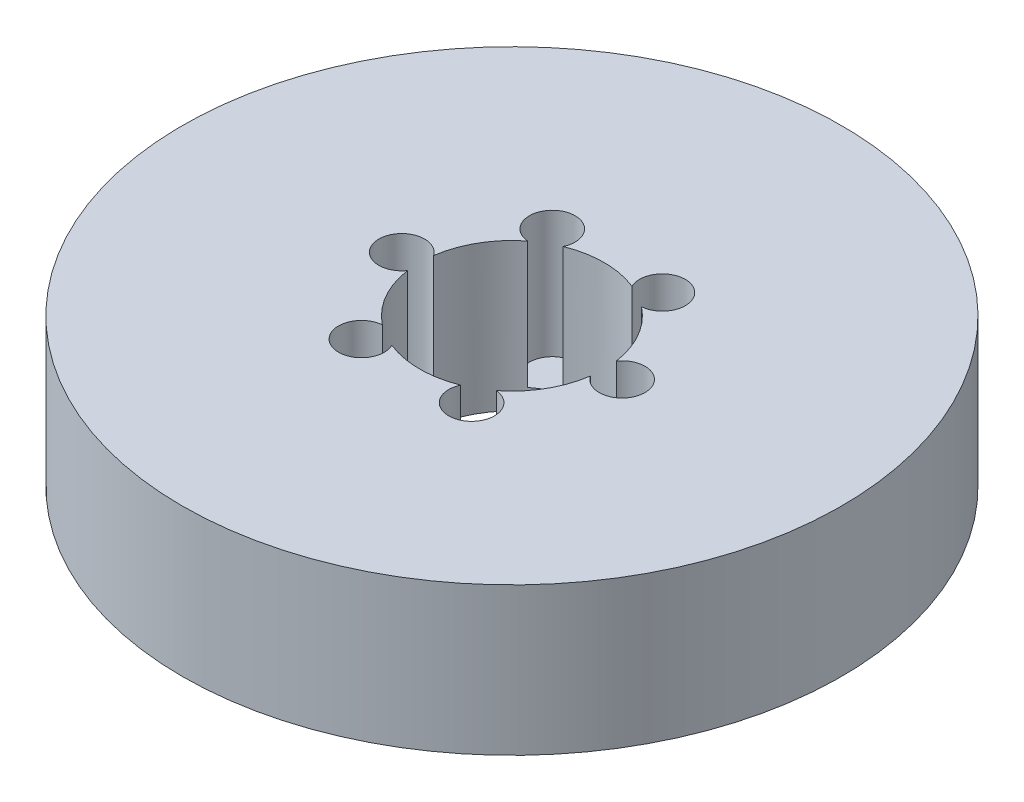
ISO-10303-21;
HEADER;
FILE_DESCRIPTION(('STEP AP214'),'2;1');
FILE_NAME('part.step','',(''),(''),'','','');
FILE_SCHEMA(('AUTOMOTIVE_DESIGN { 1 0 10303 214 1 1 1 1 }'));
ENDSEC;
DATA;
#1=APPLICATION_CONTEXT('core data for automotive mechanical design processes');
#2=APPLICATION_PROTOCOL_DEFINITION('international standard','automotive_design',2000,#1);
#3=PRODUCT_CONTEXT('',#1,'mechanical');
#4=PRODUCT('Part','Part','',(#3));
#5=PRODUCT_RELATED_PRODUCT_CATEGORY('part','',(#4));
#6=PRODUCT_DEFINITION_FORMATION('','',#4);
#7=PRODUCT_DEFINITION_CONTEXT('part definition',#1,'design');
#8=PRODUCT_DEFINITION('design','',#6,#7);
#9=PRODUCT_DEFINITION_SHAPE('','',#8);
#10=(LENGTH_UNIT() NAMED_UNIT(*) SI_UNIT(.MILLI.,.METRE.));
#11=(NAMED_UNIT(*) PLANE_ANGLE_UNIT() SI_UNIT($,.RADIAN.));
#12=(NAMED_UNIT(*) SI_UNIT($,.STERADIAN.) SOLID_ANGLE_UNIT());
#13=UNCERTAINTY_MEASURE_WITH_UNIT(LENGTH_MEASURE(1.E-05),#10,'distance_accuracy_value','');
#14=(GEOMETRIC_REPRESENTATION_CONTEXT(3) GLOBAL_UNCERTAINTY_ASSIGNED_CONTEXT((#13)) GLOBAL_UNIT_ASSIGNED_CONTEXT((#10,
#11,#12)) REPRESENTATION_CONTEXT('',''));
#15=CARTESIAN_POINT('',(0.,0.,0.));
#16=DIRECTION('',(0.,0.,1.));
#17=DIRECTION('',(1.,0.,0.));
#18=AXIS2_PLACEMENT_3D('',#15,#16,#17);
#19=CARTESIAN_POINT('',(0.,28.,0.));
#20=DIRECTION('',(0.,-1.,0.));
#21=DIRECTION('',(0.,0.,-1.));
#22=AXIS2_PLACEMENT_3D('',#19,#20,#21);
#23=CYLINDRICAL_SURFACE('',#22,62.5);
#24=CARTESIAN_POINT('',(0.,28.,0.));
#25=DIRECTION('',(0.,1.,0.));
#26=DIRECTION('',(0.,0.,1.));
#27=AXIS2_PLACEMENT_3D('',#24,#25,#26);
#28=CIRCLE('',#27,62.5);
#29=CARTESIAN_POINT('',(0.,28.,62.5));
#30=VERTEX_POINT('',#29);
#31=EDGE_CURVE('E171',#30,#30,#28,.T.);
#32=ORIENTED_EDGE('',*,*,#31,.F.);
#33=EDGE_LOOP('',(#32));
#34=FACE_BOUND('',#33,.T.);
#35=CARTESIAN_POINT('',(0.,0.,0.));
#36=DIRECTION('',(0.,1.,0.));
#37=DIRECTION('',(0.,0.,1.));
#38=AXIS2_PLACEMENT_3D('',#35,#36,#37);
#39=CIRCLE('',#38,62.5);
#40=CARTESIAN_POINT('',(0.,0.,62.5));
#41=VERTEX_POINT('',#40);
#42=EDGE_CURVE('E157',#41,#41,#39,.T.);
#43=ORIENTED_EDGE('',*,*,#42,.T.);
#44=EDGE_LOOP('',(#43));
#45=FACE_BOUND('',#44,.T.);
#46=ADVANCED_FACE('F39',(#34,#45),#23,.T.);
#47=CARTESIAN_POINT('',(0.,28.,0.));
#48=DIRECTION('',(0.,1.,0.));
#49=DIRECTION('',(0.,0.,1.));
#50=AXIS2_PLACEMENT_3D('',#47,#48,#49);
#51=PLANE('',#50);
#52=CARTESIAN_POINT('',(-10.4463455272902,28.,-18.0936012066861));
#53=DIRECTION('',(0.,1.,0.));
#54=DIRECTION('',(-0.866025403784433,0.,0.50000000000001));
#55=AXIS2_PLACEMENT_3D('',#52,#53,#54);
#56=CIRCLE('',#55,4.33798350476234);
#57=CARTESIAN_POINT('',(-6.52530040470961,28.,-16.2379325847934));
#58=VERTEX_POINT('',#57);
#59=CARTESIAN_POINT('',(-10.7998119210158,28.,-13.7700422101999));
#60=VERTEX_POINT('',#59);
#61=EDGE_CURVE('E214',#58,#60,#56,.T.);
#62=ORIENTED_EDGE('',*,*,#61,.F.);
#63=CARTESIAN_POINT('',(0.,28.,0.));
#64=DIRECTION('',(0.,1.,0.));
#65=DIRECTION('',(0.,0.,1.));
#66=AXIS2_PLACEMENT_3D('',#63,#64,#65);
#67=CIRCLE('',#66,17.5);
#68=CARTESIAN_POINT('',(6.52530040470927,28.,-16.2379325847936));
#69=VERTEX_POINT('',#68);
#70=EDGE_CURVE('E272',#69,#58,#67,.T.);
#71=ORIENTED_EDGE('',*,*,#70,.F.);
#72=CARTESIAN_POINT('',(10.4463455272898,28.,-18.0936012066863));
#73=DIRECTION('',(0.,1.,0.));
#74=DIRECTION('',(-0.866025403784443,0.,-0.499999999999992));
#75=AXIS2_PLACEMENT_3D('',#72,#73,#74);
#76=CIRCLE('',#75,4.33798350476234);
#77=CARTESIAN_POINT('',(10.7998119210155,28.,-13.7700422102001));
#78=VERTEX_POINT('',#77);
#79=EDGE_CURVE('E285',#78,#69,#76,.T.);
#80=ORIENTED_EDGE('',*,*,#79,.F.);
#81=CARTESIAN_POINT('',(17.325112325725,28.,-2.46789037459352));
#82=VERTEX_POINT('',#81);
#83=EDGE_CURVE('E165',#82,#78,#67,.T.);
#84=ORIENTED_EDGE('',*,*,#83,.F.);
#85=CARTESIAN_POINT('',(20.89269105458,28.,0.));
#86=DIRECTION('',(0.,1.,0.));
#87=DIRECTION('',(0.,0.,-1.));
#88=AXIS2_PLACEMENT_3D('',#85,#86,#87);
#89=CIRCLE('',#88,4.33798350476234);
#90=CARTESIAN_POINT('',(17.325112325725,28.,2.46789037459352));
#91=VERTEX_POINT('',#90);
#92=EDGE_CURVE('E281',#91,#82,#89,.T.);
#93=ORIENTED_EDGE('',*,*,#92,.F.);
#94=CARTESIAN_POINT('',(10.7998119210157,28.,13.7700422102));
#95=VERTEX_POINT('',#94);
#96=EDGE_CURVE('E160',#95,#91,#67,.T.);
#97=ORIENTED_EDGE('',*,*,#96,.F.);
#98=CARTESIAN_POINT('',(10.4463455272901,28.,18.0936012066862));
#99=DIRECTION('',(0.,1.,0.));
#100=DIRECTION('',(0.866025403784436,0.,-0.500000000000004));
#101=AXIS2_PLACEMENT_3D('',#98,#99,#100);
#102=CIRCLE('',#101,4.33798350476234);
#103=CARTESIAN_POINT('',(6.5253004047095,28.,16.2379325847935));
#104=VERTEX_POINT('',#103);
#105=EDGE_CURVE('E154',#104,#95,#102,.T.);
#106=ORIENTED_EDGE('',*,*,#105,.F.);
#107=CARTESIAN_POINT('',(-6.52530040470939,28.,16.2379325847935));
#108=VERTEX_POINT('',#107);
#109=EDGE_CURVE('E150',#108,#104,#67,.T.);
#110=ORIENTED_EDGE('',*,*,#109,.F.);
#111=CARTESIAN_POINT('',(-10.44634552729,28.,18.0936012066862));
#112=DIRECTION('',(0.,1.,0.));
#113=DIRECTION('',(0.86602540378444,0.,0.499999999999998));
#114=AXIS2_PLACEMENT_3D('',#111,#112,#113);
#115=CIRCLE('',#114,4.33798350476234);
#116=CARTESIAN_POINT('',(-10.7998119210156,28.,13.7700422102));
#117=VERTEX_POINT('',#116);
#118=EDGE_CURVE('E127',#117,#108,#115,.T.);
#119=ORIENTED_EDGE('',*,*,#118,.F.);
#120=CARTESIAN_POINT('',(-17.325112325725,28.,2.46789037459352));
#121=VERTEX_POINT('',#120);
#122=EDGE_CURVE('E156',#121,#117,#67,.T.);
#123=ORIENTED_EDGE('',*,*,#122,.F.);
#124=CARTESIAN_POINT('',(-20.89269105458,28.,0.));
#125=DIRECTION('',(0.,1.,0.));
#126=DIRECTION('',(0.,0.,1.));
#127=AXIS2_PLACEMENT_3D('',#124,#125,#126);
#128=CIRCLE('',#127,4.33798350476234);
#129=CARTESIAN_POINT('',(-17.325112325725,28.,-2.46789037459352));
#130=VERTEX_POINT('',#129);
#131=EDGE_CURVE('E164',#130,#121,#128,.T.);
#132=ORIENTED_EDGE('',*,*,#131,.F.);
#133=EDGE_CURVE('E159',#60,#130,#67,.T.);
#134=ORIENTED_EDGE('',*,*,#133,.F.);
#135=EDGE_LOOP('',(#62,#71,#80,#84,#93,#97,#106,#110,#119,#123,#132,#134));
#136=FACE_BOUND('',#135,.T.);
#137=ORIENTED_EDGE('',*,*,#31,.T.);
#138=EDGE_LOOP('',(#137));
#139=FACE_BOUND('',#138,.T.);
#140=ADVANCED_FACE('F155',(#136,#139),#51,.T.);
#141=CARTESIAN_POINT('',(0.,0.,0.));
#142=DIRECTION('',(0.,1.,0.));
#143=DIRECTION('',(0.,0.,1.));
#144=AXIS2_PLACEMENT_3D('',#141,#142,#143);
#145=PLANE('',#144);
#146=CARTESIAN_POINT('',(0.,0.,0.));
#147=DIRECTION('',(0.,1.,0.));
#148=DIRECTION('',(0.,0.,1.));
#149=AXIS2_PLACEMENT_3D('',#146,#147,#148);
#150=CIRCLE('',#149,17.5);
#151=CARTESIAN_POINT('',(0.,0.,17.5));
#152=VERTEX_POINT('',#151);
#153=EDGE_CURVE('E170',#152,#152,#150,.T.);
#154=ORIENTED_EDGE('',*,*,#153,.T.);
#155=EDGE_LOOP('',(#154));
#156=FACE_BOUND('',#155,.T.);
#157=ORIENTED_EDGE('',*,*,#42,.F.);
#158=EDGE_LOOP('',(#157));
#159=FACE_BOUND('',#158,.T.);
#160=ADVANCED_FACE('F232',(#156,#159),#145,.F.);
#161=CARTESIAN_POINT('',(0.,28.,0.));
#162=DIRECTION('',(0.,-1.,0.));
#163=DIRECTION('',(0.,0.,-1.));
#164=AXIS2_PLACEMENT_3D('',#161,#162,#163);
#165=CYLINDRICAL_SURFACE('',#164,17.5);
#166=DIRECTION('',(0.,1.,0.));
#167=VECTOR('',#166,1.);
#168=CARTESIAN_POINT('',(-6.52530040470961,15.9748456325898,-16.2379325847934));
#169=LINE('',#168,#167);
#170=CARTESIAN_POINT('',(-6.52530040470961,3.94969126517952,-16.2379325847934));
#171=VERTEX_POINT('',#170);
#172=EDGE_CURVE('E11',#171,#58,#169,.T.);
#173=ORIENTED_EDGE('',*,*,#172,.F.);
#174=CARTESIAN_POINT('',(0.,3.94969126517952,0.));
#175=DIRECTION('',(0.,1.,0.));
#176=DIRECTION('',(0.,0.,1.));
#177=AXIS2_PLACEMENT_3D('',#174,#175,#176);
#178=CIRCLE('',#177,17.5);
#179=CARTESIAN_POINT('',(-10.7998119210158,3.94969126517952,-13.7700422101999));
#180=VERTEX_POINT('',#179);
#181=EDGE_CURVE('E209',#171,#180,#178,.T.);
#182=ORIENTED_EDGE('',*,*,#181,.T.);
#183=DIRECTION('',(0.,1.,0.));
#184=VECTOR('',#183,1.);
#185=CARTESIAN_POINT('',(-10.7998119210158,15.9748456325898,-13.7700422101999));
#186=LINE('',#185,#184);
#187=EDGE_CURVE('E46',#60,#180,#186,.F.);
#188=ORIENTED_EDGE('',*,*,#187,.F.);
#189=ORIENTED_EDGE('',*,*,#133,.T.);
#190=DIRECTION('',(0.,1.,0.));
#191=VECTOR('',#190,1.);
#192=CARTESIAN_POINT('',(-17.325112325725,15.9748456325898,-2.46789037459352));
#193=LINE('',#192,#191);
#194=CARTESIAN_POINT('',(-17.325112325725,3.94969126517952,-2.46789037459352));
#195=VERTEX_POINT('',#194);
#196=EDGE_CURVE('E185',#195,#130,#193,.T.);
#197=ORIENTED_EDGE('',*,*,#196,.F.);
#198=CARTESIAN_POINT('',(0.,3.94969126517952,0.));
#199=DIRECTION('',(0.,1.,0.));
#200=DIRECTION('',(0.,0.,1.));
#201=AXIS2_PLACEMENT_3D('',#198,#199,#200);
#202=CIRCLE('',#201,17.5);
#203=CARTESIAN_POINT('',(-17.325112325725,3.94969126517952,2.46789037459352));
#204=VERTEX_POINT('',#203);
#205=EDGE_CURVE('E173',#195,#204,#202,.T.);
#206=ORIENTED_EDGE('',*,*,#205,.T.);
#207=DIRECTION('',(0.,1.,0.));
#208=VECTOR('',#207,1.);
#209=CARTESIAN_POINT('',(-17.325112325725,15.9748456325898,2.46789037459352));
#210=LINE('',#209,#208);
#211=EDGE_CURVE('E178',#121,#204,#210,.F.);
#212=ORIENTED_EDGE('',*,*,#211,.F.);
#213=ORIENTED_EDGE('',*,*,#122,.T.);
#214=DIRECTION('',(0.,1.,0.));
#215=VECTOR('',#214,1.);
#216=CARTESIAN_POINT('',(-10.7998119210156,15.9748456325898,13.7700422102));
#217=LINE('',#216,#215);
#218=CARTESIAN_POINT('',(-10.7998119210156,3.94969126517952,13.7700422102));
#219=VERTEX_POINT('',#218);
#220=EDGE_CURVE('E132',#219,#117,#217,.T.);
#221=ORIENTED_EDGE('',*,*,#220,.F.);
#222=CARTESIAN_POINT('',(0.,3.94969126517952,0.));
#223=DIRECTION('',(0.,1.,0.));
#224=DIRECTION('',(0.,0.,1.));
#225=AXIS2_PLACEMENT_3D('',#222,#223,#224);
#226=CIRCLE('',#225,17.5);
#227=CARTESIAN_POINT('',(-6.52530040470939,3.94969126517952,16.2379325847935));
#228=VERTEX_POINT('',#227);
#229=EDGE_CURVE('E146',#219,#228,#226,.T.);
#230=ORIENTED_EDGE('',*,*,#229,.T.);
#231=DIRECTION('',(0.,1.,0.));
#232=VECTOR('',#231,1.);
#233=CARTESIAN_POINT('',(-6.52530040470938,15.9748456325898,16.2379325847935));
#234=LINE('',#233,#232);
#235=EDGE_CURVE('E128',#108,#228,#234,.F.);
#236=ORIENTED_EDGE('',*,*,#235,.F.);
#237=ORIENTED_EDGE('',*,*,#109,.T.);
#238=DIRECTION('',(0.,1.,0.));
#239=VECTOR('',#238,1.);
#240=CARTESIAN_POINT('',(6.5253004047095,15.9748456325898,16.2379325847935));
#241=LINE('',#240,#239);
#242=CARTESIAN_POINT('',(6.5253004047095,3.94969126517952,16.2379325847935));
#243=VERTEX_POINT('',#242);
#244=EDGE_CURVE('E192',#243,#104,#241,.T.);
#245=ORIENTED_EDGE('',*,*,#244,.F.);
#246=CARTESIAN_POINT('',(0.,3.94969126517952,0.));
#247=DIRECTION('',(0.,1.,0.));
#248=DIRECTION('',(0.,0.,1.));
#249=AXIS2_PLACEMENT_3D('',#246,#247,#248);
#250=CIRCLE('',#249,17.5);
#251=CARTESIAN_POINT('',(10.7998119210157,3.94969126517952,13.7700422102));
#252=VERTEX_POINT('',#251);
#253=EDGE_CURVE('E190',#243,#252,#250,.T.);
#254=ORIENTED_EDGE('',*,*,#253,.T.);
#255=DIRECTION('',(0.,1.,0.));
#256=VECTOR('',#255,1.);
#257=CARTESIAN_POINT('',(10.7998119210157,15.9748456325898,13.7700422102));
#258=LINE('',#257,#256);
#259=EDGE_CURVE('E189',#95,#252,#258,.F.);
#260=ORIENTED_EDGE('',*,*,#259,.F.);
#261=ORIENTED_EDGE('',*,*,#96,.T.);
#262=DIRECTION('',(0.,1.,0.));
#263=VECTOR('',#262,1.);
#264=CARTESIAN_POINT('',(17.325112325725,15.9748456325898,2.46789037459352));
#265=LINE('',#264,#263);
#266=CARTESIAN_POINT('',(17.325112325725,3.94969126517952,2.46789037459352));
#267=VERTEX_POINT('',#266);
#268=EDGE_CURVE('E203',#267,#91,#265,.T.);
#269=ORIENTED_EDGE('',*,*,#268,.F.);
#270=CARTESIAN_POINT('',(0.,3.94969126517952,0.));
#271=DIRECTION('',(0.,1.,0.));
#272=DIRECTION('',(0.,0.,1.));
#273=AXIS2_PLACEMENT_3D('',#270,#271,#272);
#274=CIRCLE('',#273,17.5);
#275=CARTESIAN_POINT('',(17.325112325725,3.94969126517952,-2.46789037459352));
#276=VERTEX_POINT('',#275);
#277=EDGE_CURVE('E194',#267,#276,#274,.T.);
#278=ORIENTED_EDGE('',*,*,#277,.T.);
#279=DIRECTION('',(0.,1.,0.));
#280=VECTOR('',#279,1.);
#281=CARTESIAN_POINT('',(17.325112325725,15.9748456325898,-2.46789037459352));
#282=LINE('',#281,#280);
#283=EDGE_CURVE('E196',#82,#276,#282,.F.);
#284=ORIENTED_EDGE('',*,*,#283,.F.);
#285=ORIENTED_EDGE('',*,*,#83,.T.);
#286=DIRECTION('',(0.,1.,0.));
#287=VECTOR('',#286,1.);
#288=CARTESIAN_POINT('',(10.7998119210155,15.9748456325898,-13.7700422102001));
#289=LINE('',#288,#287);
#290=CARTESIAN_POINT('',(10.7998119210155,3.94969126517952,-13.7700422102001));
#291=VERTEX_POINT('',#290);
#292=EDGE_CURVE('E208',#291,#78,#289,.T.);
#293=ORIENTED_EDGE('',*,*,#292,.F.);
#294=CARTESIAN_POINT('',(0.,3.94969126517952,0.));
#295=DIRECTION('',(0.,1.,0.));
#296=DIRECTION('',(0.,0.,1.));
#297=AXIS2_PLACEMENT_3D('',#294,#295,#296);
#298=CIRCLE('',#297,17.5);
#299=CARTESIAN_POINT('',(6.52530040470927,3.94969126517952,-16.2379325847936));
#300=VERTEX_POINT('',#299);
#301=EDGE_CURVE('E201',#291,#300,#298,.T.);
#302=ORIENTED_EDGE('',*,*,#301,.T.);
#303=DIRECTION('',(0.,1.,0.));
#304=VECTOR('',#303,1.);
#305=CARTESIAN_POINT('',(6.52530040470927,15.9748456325898,-16.2379325847936));
#306=LINE('',#305,#304);
#307=EDGE_CURVE('E206',#69,#300,#306,.F.);
#308=ORIENTED_EDGE('',*,*,#307,.F.);
#309=ORIENTED_EDGE('',*,*,#70,.T.);
#310=EDGE_LOOP('',(#173,#182,#188,#189,#197,#206,#212,#213,#221,#230,#236,#237,#245,#254,#260,
#261,#269,#278,#284,#285,#293,#302,#308,#309));
#311=FACE_BOUND('',#310,.T.);
#312=ORIENTED_EDGE('',*,*,#153,.F.);
#313=EDGE_LOOP('',(#312));
#314=FACE_BOUND('',#313,.T.);
#315=ADVANCED_FACE('F145',(#311,#314),#165,.F.);
#316=CARTESIAN_POINT('',(-20.89269105458,3.94969126517952,0.));
#317=DIRECTION('',(0.,1.,0.));
#318=DIRECTION('',(0.,0.,1.));
#319=AXIS2_PLACEMENT_3D('',#316,#317,#318);
#320=CYLINDRICAL_SURFACE('',#319,4.33798350476234);
#321=ORIENTED_EDGE('',*,*,#196,.T.);
#322=ORIENTED_EDGE('',*,*,#131,.T.);
#323=ORIENTED_EDGE('',*,*,#211,.T.);
#324=CARTESIAN_POINT('',(-20.89269105458,3.94969126517952,0.));
#325=DIRECTION('',(0.,1.,0.));
#326=DIRECTION('',(0.,0.,1.));
#327=AXIS2_PLACEMENT_3D('',#324,#325,#326);
#328=CIRCLE('',#327,4.33798350476234);
#329=EDGE_CURVE('E168',#195,#204,#328,.T.);
#330=ORIENTED_EDGE('',*,*,#329,.F.);
#331=EDGE_LOOP('',(#321,#322,#323,#330));
#332=FACE_BOUND('',#331,.T.);
#333=ADVANCED_FACE('F243',(#332),#320,.F.);
#334=CARTESIAN_POINT('',(-20.89269105458,3.94969126517952,0.));
#335=DIRECTION('',(0.,1.,0.));
#336=DIRECTION('',(0.,0.,1.));
#337=AXIS2_PLACEMENT_3D('',#334,#335,#336);
#338=PLANE('',#337);
#339=ORIENTED_EDGE('',*,*,#329,.T.);
#340=ORIENTED_EDGE('',*,*,#205,.F.);
#341=EDGE_LOOP('',(#339,#340));
#342=FACE_BOUND('',#341,.T.);
#343=ADVANCED_FACE('F247',(#342),#338,.T.);
#344=CARTESIAN_POINT('',(-10.44634552729,3.94969126517952,18.0936012066862));
#345=DIRECTION('',(0.,1.,0.));
#346=DIRECTION('',(0.,0.,1.));
#347=AXIS2_PLACEMENT_3D('',#344,#345,#346);
#348=CYLINDRICAL_SURFACE('',#347,4.33798350476234);
#349=ORIENTED_EDGE('',*,*,#220,.T.);
#350=ORIENTED_EDGE('',*,*,#118,.T.);
#351=ORIENTED_EDGE('',*,*,#235,.T.);
#352=CARTESIAN_POINT('',(-10.44634552729,3.94969126517952,18.0936012066862));
#353=DIRECTION('',(0.,1.,0.));
#354=DIRECTION('',(0.86602540378444,0.,0.499999999999998));
#355=AXIS2_PLACEMENT_3D('',#352,#353,#354);
#356=CIRCLE('',#355,4.33798350476234);
#357=EDGE_CURVE('E137',#219,#228,#356,.T.);
#358=ORIENTED_EDGE('',*,*,#357,.F.);
#359=EDGE_LOOP('',(#349,#350,#351,#358));
#360=FACE_BOUND('',#359,.T.);
#361=ADVANCED_FACE('F126',(#360),#348,.F.);
#362=CARTESIAN_POINT('',(-10.44634552729,3.94969126517952,18.0936012066862));
#363=DIRECTION('',(0.,1.,0.));
#364=DIRECTION('',(0.86602540378444,0.,0.499999999999998));
#365=AXIS2_PLACEMENT_3D('',#362,#363,#364);
#366=PLANE('',#365);
#367=ORIENTED_EDGE('',*,*,#357,.T.);
#368=ORIENTED_EDGE('',*,*,#229,.F.);
#369=EDGE_LOOP('',(#367,#368));
#370=FACE_BOUND('',#369,.T.);
#371=ADVANCED_FACE('F254',(#370),#366,.T.);
#372=CARTESIAN_POINT('',(10.4463455272901,3.94969126517952,18.0936012066862));
#373=DIRECTION('',(0.,1.,0.));
#374=DIRECTION('',(0.,0.,1.));
#375=AXIS2_PLACEMENT_3D('',#372,#373,#374);
#376=CYLINDRICAL_SURFACE('',#375,4.33798350476234);
#377=ORIENTED_EDGE('',*,*,#244,.T.);
#378=ORIENTED_EDGE('',*,*,#105,.T.);
#379=ORIENTED_EDGE('',*,*,#259,.T.);
#380=CARTESIAN_POINT('',(10.4463455272901,3.94969126517952,18.0936012066862));
#381=DIRECTION('',(0.,1.,0.));
#382=DIRECTION('',(0.866025403784436,0.,-0.500000000000004));
#383=AXIS2_PLACEMENT_3D('',#380,#381,#382);
#384=CIRCLE('',#383,4.33798350476234);
#385=EDGE_CURVE('E138',#243,#252,#384,.T.);
#386=ORIENTED_EDGE('',*,*,#385,.F.);
#387=EDGE_LOOP('',(#377,#378,#379,#386));
#388=FACE_BOUND('',#387,.T.);
#389=ADVANCED_FACE('F260',(#388),#376,.F.);
#390=CARTESIAN_POINT('',(10.4463455272901,3.94969126517952,18.0936012066862));
#391=DIRECTION('',(0.,1.,0.));
#392=DIRECTION('',(0.866025403784436,0.,-0.500000000000004));
#393=AXIS2_PLACEMENT_3D('',#390,#391,#392);
#394=PLANE('',#393);
#395=ORIENTED_EDGE('',*,*,#385,.T.);
#396=ORIENTED_EDGE('',*,*,#253,.F.);
#397=EDGE_LOOP('',(#395,#396));
#398=FACE_BOUND('',#397,.T.);
#399=ADVANCED_FACE('F265',(#398),#394,.T.);
#400=CARTESIAN_POINT('',(20.89269105458,3.94969126517952,0.));
#401=DIRECTION('',(0.,1.,0.));
#402=DIRECTION('',(0.,0.,1.));
#403=AXIS2_PLACEMENT_3D('',#400,#401,#402);
#404=CYLINDRICAL_SURFACE('',#403,4.33798350476234);
#405=ORIENTED_EDGE('',*,*,#268,.T.);
#406=ORIENTED_EDGE('',*,*,#92,.T.);
#407=ORIENTED_EDGE('',*,*,#283,.T.);
#408=CARTESIAN_POINT('',(20.89269105458,3.94969126517952,0.));
#409=DIRECTION('',(0.,1.,0.));
#410=DIRECTION('',(0.,0.,-1.));
#411=AXIS2_PLACEMENT_3D('',#408,#409,#410);
#412=CIRCLE('',#411,4.33798350476234);
#413=EDGE_CURVE('E287',#267,#276,#412,.T.);
#414=ORIENTED_EDGE('',*,*,#413,.F.);
#415=EDGE_LOOP('',(#405,#406,#407,#414));
#416=FACE_BOUND('',#415,.T.);
#417=ADVANCED_FACE('F300',(#416),#404,.F.);
#418=CARTESIAN_POINT('',(20.89269105458,3.94969126517952,0.));
#419=DIRECTION('',(0.,1.,0.));
#420=DIRECTION('',(0.,0.,-1.));
#421=AXIS2_PLACEMENT_3D('',#418,#419,#420);
#422=PLANE('',#421);
#423=ORIENTED_EDGE('',*,*,#413,.T.);
#424=ORIENTED_EDGE('',*,*,#277,.F.);
#425=EDGE_LOOP('',(#423,#424));
#426=FACE_BOUND('',#425,.T.);
#427=ADVANCED_FACE('F298',(#426),#422,.T.);
#428=CARTESIAN_POINT('',(10.4463455272898,3.94969126517952,-18.0936012066863));
#429=DIRECTION('',(0.,1.,0.));
#430=DIRECTION('',(0.,0.,1.));
#431=AXIS2_PLACEMENT_3D('',#428,#429,#430);
#432=CYLINDRICAL_SURFACE('',#431,4.33798350476234);
#433=ORIENTED_EDGE('',*,*,#292,.T.);
#434=ORIENTED_EDGE('',*,*,#79,.T.);
#435=ORIENTED_EDGE('',*,*,#307,.T.);
#436=CARTESIAN_POINT('',(10.4463455272898,3.94969126517952,-18.0936012066863));
#437=DIRECTION('',(0.,1.,0.));
#438=DIRECTION('',(-0.866025403784443,0.,-0.499999999999992));
#439=AXIS2_PLACEMENT_3D('',#436,#437,#438);
#440=CIRCLE('',#439,4.33798350476234);
#441=EDGE_CURVE('E56',#291,#300,#440,.T.);
#442=ORIENTED_EDGE('',*,*,#441,.F.);
#443=EDGE_LOOP('',(#433,#434,#435,#442));
#444=FACE_BOUND('',#443,.T.);
#445=ADVANCED_FACE('F301',(#444),#432,.F.);
#446=CARTESIAN_POINT('',(10.4463455272898,3.94969126517952,-18.0936012066863));
#447=DIRECTION('',(0.,1.,0.));
#448=DIRECTION('',(-0.866025403784443,0.,-0.499999999999992));
#449=AXIS2_PLACEMENT_3D('',#446,#447,#448);
#450=PLANE('',#449);
#451=ORIENTED_EDGE('',*,*,#441,.T.);
#452=ORIENTED_EDGE('',*,*,#301,.F.);
#453=EDGE_LOOP('',(#451,#452));
#454=FACE_BOUND('',#453,.T.);
#455=ADVANCED_FACE('F221',(#454),#450,.T.);
#456=CARTESIAN_POINT('',(-10.4463455272902,3.94969126517952,-18.0936012066861));
#457=DIRECTION('',(0.,1.,0.));
#458=DIRECTION('',(0.,0.,1.));
#459=AXIS2_PLACEMENT_3D('',#456,#457,#458);
#460=CYLINDRICAL_SURFACE('',#459,4.33798350476234);
#461=ORIENTED_EDGE('',*,*,#172,.T.);
#462=ORIENTED_EDGE('',*,*,#61,.T.);
#463=ORIENTED_EDGE('',*,*,#187,.T.);
#464=CARTESIAN_POINT('',(-10.4463455272902,3.94969126517952,-18.0936012066861));
#465=DIRECTION('',(0.,1.,0.));
#466=DIRECTION('',(-0.866025403784433,0.,0.50000000000001));
#467=AXIS2_PLACEMENT_3D('',#464,#465,#466);
#468=CIRCLE('',#467,4.33798350476234);
#469=EDGE_CURVE('E55',#171,#180,#468,.T.);
#470=ORIENTED_EDGE('',*,*,#469,.F.);
#471=EDGE_LOOP('',(#461,#462,#463,#470));
#472=FACE_BOUND('',#471,.T.);
#473=ADVANCED_FACE('F212',(#472),#460,.F.);
#474=CARTESIAN_POINT('',(-10.4463455272902,3.94969126517952,-18.0936012066861));
#475=DIRECTION('',(0.,1.,0.));
#476=DIRECTION('',(-0.866025403784433,0.,0.50000000000001));
#477=AXIS2_PLACEMENT_3D('',#474,#475,#476);
#478=PLANE('',#477);
#479=ORIENTED_EDGE('',*,*,#469,.T.);
#480=ORIENTED_EDGE('',*,*,#181,.F.);
#481=EDGE_LOOP('',(#479,#480));
#482=FACE_BOUND('',#481,.T.);
#483=ADVANCED_FACE('F217',(#482),#478,.T.);
#484=CLOSED_SHELL('',(#46,#140,#160,#315,#333,#343,#361,#371,#389,#399,#417,#427,#445,#455,#473,#483));
#485=MANIFOLD_SOLID_BREP('B2',#484);
#486=ADVANCED_BREP_SHAPE_REPRESENTATION('',(#18,#485),#14);
#487=SHAPE_DEFINITION_REPRESENTATION(#9,#486);
ENDSEC;
END-ISO-10303-21;
